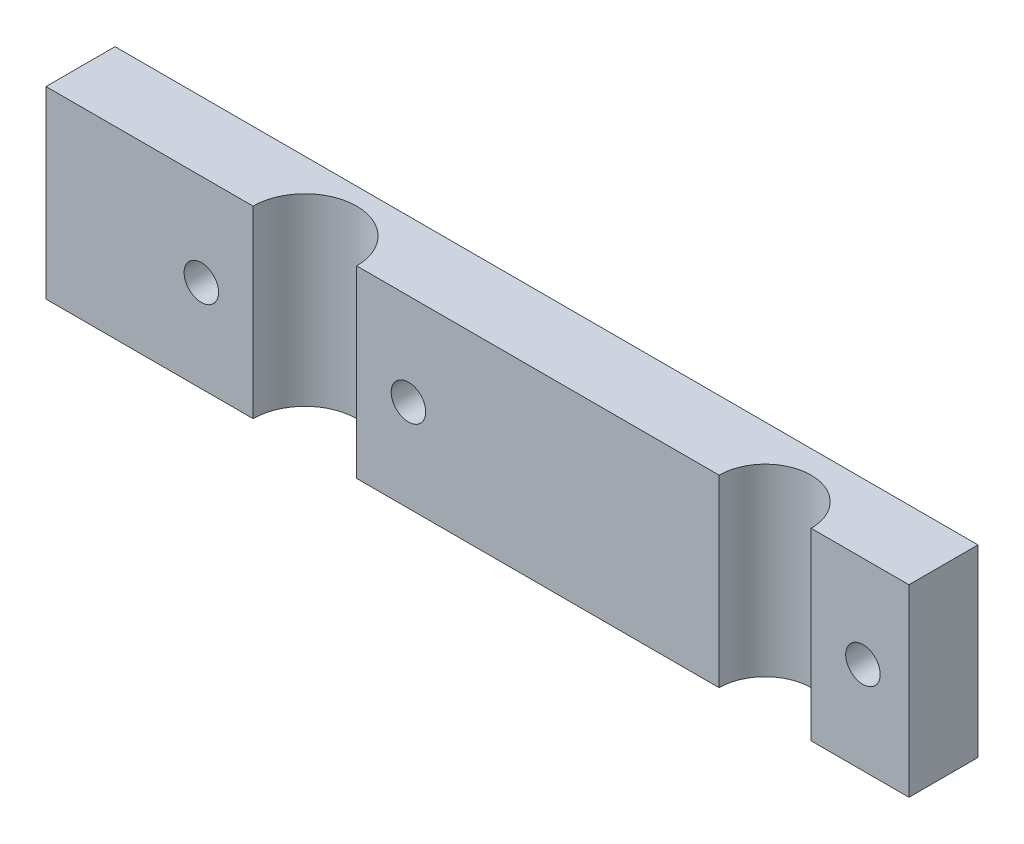
ISO-10303-21;
HEADER;
FILE_DESCRIPTION(('STEP AP214'),'2;1');
FILE_NAME('part.step','',(''),(''),'','','');
FILE_SCHEMA(('AUTOMOTIVE_DESIGN { 1 0 10303 214 1 1 1 1 }'));
ENDSEC;
DATA;
#1=APPLICATION_CONTEXT('core data for automotive mechanical design processes');
#2=APPLICATION_PROTOCOL_DEFINITION('international standard','automotive_design',2000,#1);
#3=PRODUCT_CONTEXT('',#1,'mechanical');
#4=PRODUCT('Part','Part','',(#3));
#5=PRODUCT_RELATED_PRODUCT_CATEGORY('part','',(#4));
#6=PRODUCT_DEFINITION_FORMATION('','',#4);
#7=PRODUCT_DEFINITION_CONTEXT('part definition',#1,'design');
#8=PRODUCT_DEFINITION('design','',#6,#7);
#9=PRODUCT_DEFINITION_SHAPE('','',#8);
#10=(LENGTH_UNIT() NAMED_UNIT(*) SI_UNIT(.MILLI.,.METRE.));
#11=(NAMED_UNIT(*) PLANE_ANGLE_UNIT() SI_UNIT($,.RADIAN.));
#12=(NAMED_UNIT(*) SI_UNIT($,.STERADIAN.) SOLID_ANGLE_UNIT());
#13=UNCERTAINTY_MEASURE_WITH_UNIT(LENGTH_MEASURE(1.E-05),#10,'distance_accuracy_value','');
#14=(GEOMETRIC_REPRESENTATION_CONTEXT(3) GLOBAL_UNCERTAINTY_ASSIGNED_CONTEXT((#13)) GLOBAL_UNIT_ASSIGNED_CONTEXT((#10,
#11,#12)) REPRESENTATION_CONTEXT('',''));
#15=CARTESIAN_POINT('',(0.,0.,0.));
#16=DIRECTION('',(0.,0.,1.));
#17=DIRECTION('',(1.,0.,0.));
#18=AXIS2_PLACEMENT_3D('',#15,#16,#17);
#19=CARTESIAN_POINT('',(0.,0.,12.));
#20=DIRECTION('',(0.,0.,1.));
#21=DIRECTION('',(1.,0.,0.));
#22=AXIS2_PLACEMENT_3D('',#19,#20,#21);
#23=PLANE('',#22);
#24=CARTESIAN_POINT('',(-12.,0.,12.));
#25=DIRECTION('',(0.,0.,1.));
#26=DIRECTION('',(1.,0.,0.));
#27=AXIS2_PLACEMENT_3D('',#24,#25,#26);
#28=CIRCLE('',#27,3.);
#29=CARTESIAN_POINT('',(-8.99999999999997,0.,12.));
#30=VERTEX_POINT('',#29);
#31=EDGE_CURVE('E164',#30,#30,#28,.T.);
#32=ORIENTED_EDGE('',*,*,#31,.F.);
#33=EDGE_LOOP('',(#32));
#34=FACE_BOUND('',#33,.T.);
#35=DIRECTION('',(0.,1.,0.));
#36=VECTOR('',#35,1.);
#37=CARTESIAN_POINT('',(-21.,-44.,12.));
#38=LINE('',#37,#36);
#39=CARTESIAN_POINT('',(-21.,-16.,12.));
#40=VERTEX_POINT('',#39);
#41=CARTESIAN_POINT('',(-21.,16.,12.));
#42=VERTEX_POINT('',#41);
#43=EDGE_CURVE('E11',#40,#42,#38,.T.);
#44=ORIENTED_EDGE('',*,*,#43,.F.);
#45=DIRECTION('',(1.,0.,0.));
#46=VECTOR('',#45,1.);
#47=CARTESIAN_POINT('',(-75.,-16.,12.));
#48=LINE('',#47,#46);
#49=CARTESIAN_POINT('',(42.,-16.,12.));
#50=VERTEX_POINT('',#49);
#51=EDGE_CURVE('E175',#40,#50,#48,.T.);
#52=ORIENTED_EDGE('',*,*,#51,.T.);
#53=DIRECTION('',(0.,1.,0.));
#54=VECTOR('',#53,1.);
#55=CARTESIAN_POINT('',(42.,-44.,12.));
#56=LINE('',#55,#54);
#57=CARTESIAN_POINT('',(42.,16.,12.));
#58=VERTEX_POINT('',#57);
#59=EDGE_CURVE('E115',#58,#50,#56,.F.);
#60=ORIENTED_EDGE('',*,*,#59,.F.);
#61=DIRECTION('',(-1.,0.,0.));
#62=VECTOR('',#61,1.);
#63=CARTESIAN_POINT('',(-75.,16.,12.));
#64=LINE('',#63,#62);
#65=EDGE_CURVE('E110',#58,#42,#64,.T.);
#66=ORIENTED_EDGE('',*,*,#65,.T.);
#67=EDGE_LOOP('',(#44,#52,#60,#66));
#68=FACE_BOUND('',#67,.T.);
#69=ADVANCED_FACE('F35',(#34,#68),#23,.T.);
#70=CARTESIAN_POINT('',(67.,0.,12.));
#71=DIRECTION('',(0.,0.,1.));
#72=DIRECTION('',(1.,0.,0.));
#73=AXIS2_PLACEMENT_3D('',#70,#71,#72);
#74=CIRCLE('',#73,3.00000000000001);
#75=CARTESIAN_POINT('',(70.,0.,12.));
#76=VERTEX_POINT('',#75);
#77=EDGE_CURVE('E151',#76,#76,#74,.T.);
#78=ORIENTED_EDGE('',*,*,#77,.F.);
#79=EDGE_LOOP('',(#78));
#80=FACE_BOUND('',#79,.T.);
#81=DIRECTION('',(0.,1.,0.));
#82=VECTOR('',#81,1.);
#83=CARTESIAN_POINT('',(58.,-44.,12.));
#84=LINE('',#83,#82);
#85=CARTESIAN_POINT('',(58.,-16.,12.));
#86=VERTEX_POINT('',#85);
#87=CARTESIAN_POINT('',(58.,16.,12.));
#88=VERTEX_POINT('',#87);
#89=EDGE_CURVE('E147',#86,#88,#84,.T.);
#90=ORIENTED_EDGE('',*,*,#89,.F.);
#91=CARTESIAN_POINT('',(75.,-16.,12.));
#92=VERTEX_POINT('',#91);
#93=EDGE_CURVE('E172',#86,#92,#48,.T.);
#94=ORIENTED_EDGE('',*,*,#93,.T.);
#95=DIRECTION('',(0.,1.,0.));
#96=VECTOR('',#95,1.);
#97=CARTESIAN_POINT('',(75.,16.,12.));
#98=LINE('',#97,#96);
#99=CARTESIAN_POINT('',(75.,16.,12.));
#100=VERTEX_POINT('',#99);
#101=EDGE_CURVE('E120',#92,#100,#98,.T.);
#102=ORIENTED_EDGE('',*,*,#101,.T.);
#103=EDGE_CURVE('E116',#100,#88,#64,.T.);
#104=ORIENTED_EDGE('',*,*,#103,.T.);
#105=EDGE_LOOP('',(#90,#94,#102,#104));
#106=FACE_BOUND('',#105,.T.);
#107=ADVANCED_FACE('F181',(#80,#106),#23,.T.);
#108=CARTESIAN_POINT('',(-75.,16.,12.));
#109=DIRECTION('',(1.,0.,0.));
#110=DIRECTION('',(0.,0.,-1.));
#111=AXIS2_PLACEMENT_3D('',#108,#109,#110);
#112=PLANE('',#111);
#113=DIRECTION('',(0.,-1.,0.));
#114=VECTOR('',#113,1.);
#115=CARTESIAN_POINT('',(-75.,16.,0.));
#116=LINE('',#115,#114);
#117=CARTESIAN_POINT('',(-75.,16.,0.));
#118=VERTEX_POINT('',#117);
#119=CARTESIAN_POINT('',(-75.,-16.,0.));
#120=VERTEX_POINT('',#119);
#121=EDGE_CURVE('E124',#118,#120,#116,.T.);
#122=ORIENTED_EDGE('',*,*,#121,.T.);
#123=DIRECTION('',(0.,0.,-1.));
#124=VECTOR('',#123,1.);
#125=CARTESIAN_POINT('',(-75.,-16.,12.));
#126=LINE('',#125,#124);
#127=CARTESIAN_POINT('',(-75.,-16.,12.));
#128=VERTEX_POINT('',#127);
#129=EDGE_CURVE('E143',#128,#120,#126,.T.);
#130=ORIENTED_EDGE('',*,*,#129,.F.);
#131=DIRECTION('',(0.,-1.,0.));
#132=VECTOR('',#131,1.);
#133=CARTESIAN_POINT('',(-75.,16.,12.));
#134=LINE('',#133,#132);
#135=CARTESIAN_POINT('',(-75.,16.,12.));
#136=VERTEX_POINT('',#135);
#137=EDGE_CURVE('E134',#136,#128,#134,.T.);
#138=ORIENTED_EDGE('',*,*,#137,.F.);
#139=DIRECTION('',(0.,0.,-1.));
#140=VECTOR('',#139,1.);
#141=CARTESIAN_POINT('',(-75.,16.,12.));
#142=LINE('',#141,#140);
#143=EDGE_CURVE('E119',#136,#118,#142,.T.);
#144=ORIENTED_EDGE('',*,*,#143,.T.);
#145=EDGE_LOOP('',(#122,#130,#138,#144));
#146=FACE_BOUND('',#145,.T.);
#147=ADVANCED_FACE('F37',(#146),#112,.F.);
#148=CARTESIAN_POINT('',(-75.,-16.,12.));
#149=DIRECTION('',(0.,1.,0.));
#150=DIRECTION('',(0.,0.,1.));
#151=AXIS2_PLACEMENT_3D('',#148,#149,#150);
#152=PLANE('',#151);
#153=ORIENTED_EDGE('',*,*,#51,.F.);
#154=CARTESIAN_POINT('',(-30.,-16.,12.));
#155=DIRECTION('',(0.,1.,0.));
#156=DIRECTION('',(0.,0.,1.));
#157=AXIS2_PLACEMENT_3D('',#154,#155,#156);
#158=CIRCLE('',#157,9.);
#159=CARTESIAN_POINT('',(-39.,-16.,12.));
#160=VERTEX_POINT('',#159);
#161=EDGE_CURVE('E102',#40,#160,#158,.T.);
#162=ORIENTED_EDGE('',*,*,#161,.T.);
#163=EDGE_CURVE('E173',#128,#160,#48,.T.);
#164=ORIENTED_EDGE('',*,*,#163,.F.);
#165=ORIENTED_EDGE('',*,*,#129,.T.);
#166=DIRECTION('',(1.,0.,0.));
#167=VECTOR('',#166,1.);
#168=CARTESIAN_POINT('',(-75.,-16.,0.));
#169=LINE('',#168,#167);
#170=CARTESIAN_POINT('',(75.,-16.,0.));
#171=VERTEX_POINT('',#170);
#172=EDGE_CURVE('E127',#120,#171,#169,.T.);
#173=ORIENTED_EDGE('',*,*,#172,.T.);
#174=DIRECTION('',(0.,0.,-1.));
#175=VECTOR('',#174,1.);
#176=CARTESIAN_POINT('',(75.,-16.,12.));
#177=LINE('',#176,#175);
#178=EDGE_CURVE('E140',#92,#171,#177,.T.);
#179=ORIENTED_EDGE('',*,*,#178,.F.);
#180=ORIENTED_EDGE('',*,*,#93,.F.);
#181=CARTESIAN_POINT('',(50.,-16.,12.));
#182=DIRECTION('',(0.,1.,0.));
#183=DIRECTION('',(0.,0.,1.));
#184=AXIS2_PLACEMENT_3D('',#181,#182,#183);
#185=CIRCLE('',#184,8.00000000000001);
#186=EDGE_CURVE('E128',#86,#50,#185,.T.);
#187=ORIENTED_EDGE('',*,*,#186,.T.);
#188=EDGE_LOOP('',(#153,#162,#164,#165,#173,#179,#180,#187));
#189=FACE_BOUND('',#188,.T.);
#190=ADVANCED_FACE('F185',(#189),#152,.F.);
#191=CARTESIAN_POINT('',(75.,16.,12.));
#192=DIRECTION('',(-1.,0.,0.));
#193=DIRECTION('',(0.,0.,1.));
#194=AXIS2_PLACEMENT_3D('',#191,#192,#193);
#195=PLANE('',#194);
#196=DIRECTION('',(0.,1.,0.));
#197=VECTOR('',#196,1.);
#198=CARTESIAN_POINT('',(75.,16.,0.));
#199=LINE('',#198,#197);
#200=CARTESIAN_POINT('',(75.,16.,0.));
#201=VERTEX_POINT('',#200);
#202=EDGE_CURVE('E130',#171,#201,#199,.T.);
#203=ORIENTED_EDGE('',*,*,#202,.T.);
#204=DIRECTION('',(0.,0.,-1.));
#205=VECTOR('',#204,1.);
#206=CARTESIAN_POINT('',(75.,16.,12.));
#207=LINE('',#206,#205);
#208=EDGE_CURVE('E137',#100,#201,#207,.T.);
#209=ORIENTED_EDGE('',*,*,#208,.F.);
#210=ORIENTED_EDGE('',*,*,#101,.F.);
#211=ORIENTED_EDGE('',*,*,#178,.T.);
#212=EDGE_LOOP('',(#203,#209,#210,#211));
#213=FACE_BOUND('',#212,.T.);
#214=ADVANCED_FACE('F188',(#213),#195,.F.);
#215=CARTESIAN_POINT('',(-75.,16.,12.));
#216=DIRECTION('',(0.,-1.,0.));
#217=DIRECTION('',(0.,0.,-1.));
#218=AXIS2_PLACEMENT_3D('',#215,#216,#217);
#219=PLANE('',#218);
#220=CARTESIAN_POINT('',(-39.,16.,12.));
#221=VERTEX_POINT('',#220);
#222=EDGE_CURVE('E112',#221,#136,#64,.T.);
#223=ORIENTED_EDGE('',*,*,#222,.F.);
#224=CARTESIAN_POINT('',(-30.,16.,12.));
#225=DIRECTION('',(0.,1.,0.));
#226=DIRECTION('',(0.,0.,1.));
#227=AXIS2_PLACEMENT_3D('',#224,#225,#226);
#228=CIRCLE('',#227,9.);
#229=EDGE_CURVE('E51',#42,#221,#228,.T.);
#230=ORIENTED_EDGE('',*,*,#229,.F.);
#231=ORIENTED_EDGE('',*,*,#65,.F.);
#232=CARTESIAN_POINT('',(50.,16.,12.));
#233=DIRECTION('',(0.,1.,0.));
#234=DIRECTION('',(0.,0.,1.));
#235=AXIS2_PLACEMENT_3D('',#232,#233,#234);
#236=CIRCLE('',#235,8.00000000000001);
#237=EDGE_CURVE('E59',#88,#58,#236,.T.);
#238=ORIENTED_EDGE('',*,*,#237,.F.);
#239=ORIENTED_EDGE('',*,*,#103,.F.);
#240=ORIENTED_EDGE('',*,*,#208,.T.);
#241=DIRECTION('',(-1.,0.,0.));
#242=VECTOR('',#241,1.);
#243=CARTESIAN_POINT('',(-75.,16.,0.));
#244=LINE('',#243,#242);
#245=EDGE_CURVE('E132',#201,#118,#244,.T.);
#246=ORIENTED_EDGE('',*,*,#245,.T.);
#247=ORIENTED_EDGE('',*,*,#143,.F.);
#248=EDGE_LOOP('',(#223,#230,#231,#238,#239,#240,#246,#247));
#249=FACE_BOUND('',#248,.T.);
#250=ADVANCED_FACE('F109',(#249),#219,.F.);
#251=CARTESIAN_POINT('',(-48.,0.,12.));
#252=DIRECTION('',(0.,0.,1.));
#253=DIRECTION('',(1.,0.,0.));
#254=AXIS2_PLACEMENT_3D('',#251,#252,#253);
#255=CIRCLE('',#254,3.);
#256=CARTESIAN_POINT('',(-45.,0.,12.));
#257=VERTEX_POINT('',#256);
#258=EDGE_CURVE('E154',#257,#257,#255,.T.);
#259=ORIENTED_EDGE('',*,*,#258,.F.);
#260=EDGE_LOOP('',(#259));
#261=FACE_BOUND('',#260,.T.);
#262=DIRECTION('',(0.,1.,0.));
#263=VECTOR('',#262,1.);
#264=CARTESIAN_POINT('',(-39.,-44.,12.));
#265=LINE('',#264,#263);
#266=EDGE_CURVE('E44',#221,#160,#265,.F.);
#267=ORIENTED_EDGE('',*,*,#266,.F.);
#268=ORIENTED_EDGE('',*,*,#222,.T.);
#269=ORIENTED_EDGE('',*,*,#137,.T.);
#270=ORIENTED_EDGE('',*,*,#163,.T.);
#271=EDGE_LOOP('',(#267,#268,#269,#270));
#272=FACE_BOUND('',#271,.T.);
#273=ADVANCED_FACE('F197',(#261,#272),#23,.T.);
#274=CARTESIAN_POINT('',(0.,0.,0.));
#275=DIRECTION('',(0.,0.,1.));
#276=DIRECTION('',(1.,0.,0.));
#277=AXIS2_PLACEMENT_3D('',#274,#275,#276);
#278=PLANE('',#277);
#279=CARTESIAN_POINT('',(-12.,0.,0.));
#280=DIRECTION('',(0.,0.,1.));
#281=DIRECTION('',(1.,0.,0.));
#282=AXIS2_PLACEMENT_3D('',#279,#280,#281);
#283=CIRCLE('',#282,3.);
#284=CARTESIAN_POINT('',(-8.99999999999997,0.,0.));
#285=VERTEX_POINT('',#284);
#286=EDGE_CURVE('E39',#285,#285,#283,.T.);
#287=ORIENTED_EDGE('',*,*,#286,.T.);
#288=EDGE_LOOP('',(#287));
#289=FACE_BOUND('',#288,.T.);
#290=CARTESIAN_POINT('',(-48.,0.,0.));
#291=DIRECTION('',(0.,0.,1.));
#292=DIRECTION('',(1.,0.,0.));
#293=AXIS2_PLACEMENT_3D('',#290,#291,#292);
#294=CIRCLE('',#293,3.);
#295=CARTESIAN_POINT('',(-45.,0.,0.));
#296=VERTEX_POINT('',#295);
#297=EDGE_CURVE('E152',#296,#296,#294,.T.);
#298=ORIENTED_EDGE('',*,*,#297,.T.);
#299=EDGE_LOOP('',(#298));
#300=FACE_BOUND('',#299,.T.);
#301=CARTESIAN_POINT('',(67.,0.,0.));
#302=DIRECTION('',(0.,0.,1.));
#303=DIRECTION('',(1.,0.,0.));
#304=AXIS2_PLACEMENT_3D('',#301,#302,#303);
#305=CIRCLE('',#304,3.00000000000001);
#306=CARTESIAN_POINT('',(70.,0.,0.));
#307=VERTEX_POINT('',#306);
#308=EDGE_CURVE('E113',#307,#307,#305,.T.);
#309=ORIENTED_EDGE('',*,*,#308,.T.);
#310=EDGE_LOOP('',(#309));
#311=FACE_BOUND('',#310,.T.);
#312=ORIENTED_EDGE('',*,*,#121,.F.);
#313=ORIENTED_EDGE('',*,*,#245,.F.);
#314=ORIENTED_EDGE('',*,*,#202,.F.);
#315=ORIENTED_EDGE('',*,*,#172,.F.);
#316=EDGE_LOOP('',(#312,#313,#314,#315));
#317=FACE_BOUND('',#316,.T.);
#318=ADVANCED_FACE('F193',(#289,#300,#311,#317),#278,.F.);
#319=CARTESIAN_POINT('',(50.,-44.,12.));
#320=DIRECTION('',(0.,1.,0.));
#321=DIRECTION('',(0.,0.,1.));
#322=AXIS2_PLACEMENT_3D('',#319,#320,#321);
#323=CYLINDRICAL_SURFACE('',#322,8.00000000000001);
#324=ORIENTED_EDGE('',*,*,#89,.T.);
#325=ORIENTED_EDGE('',*,*,#237,.T.);
#326=ORIENTED_EDGE('',*,*,#59,.T.);
#327=ORIENTED_EDGE('',*,*,#186,.F.);
#328=EDGE_LOOP('',(#324,#325,#326,#327));
#329=FACE_BOUND('',#328,.T.);
#330=ADVANCED_FACE('F198',(#329),#323,.F.);
#331=CARTESIAN_POINT('',(-30.,-44.,12.));
#332=DIRECTION('',(0.,1.,0.));
#333=DIRECTION('',(0.,0.,1.));
#334=AXIS2_PLACEMENT_3D('',#331,#332,#333);
#335=CYLINDRICAL_SURFACE('',#334,9.);
#336=ORIENTED_EDGE('',*,*,#43,.T.);
#337=ORIENTED_EDGE('',*,*,#229,.T.);
#338=ORIENTED_EDGE('',*,*,#266,.T.);
#339=ORIENTED_EDGE('',*,*,#161,.F.);
#340=EDGE_LOOP('',(#336,#337,#338,#339));
#341=FACE_BOUND('',#340,.T.);
#342=ADVANCED_FACE('F100',(#341),#335,.F.);
#343=CARTESIAN_POINT('',(67.,0.,-18.));
#344=DIRECTION('',(0.,0.,1.));
#345=DIRECTION('',(1.,0.,0.));
#346=AXIS2_PLACEMENT_3D('',#343,#344,#345);
#347=CYLINDRICAL_SURFACE('',#346,3.00000000000001);
#348=ORIENTED_EDGE('',*,*,#77,.T.);
#349=EDGE_LOOP('',(#348));
#350=FACE_BOUND('',#349,.T.);
#351=ORIENTED_EDGE('',*,*,#308,.F.);
#352=EDGE_LOOP('',(#351));
#353=FACE_BOUND('',#352,.T.);
#354=ADVANCED_FACE('F205',(#350,#353),#347,.F.);
#355=CARTESIAN_POINT('',(-48.,0.,-18.));
#356=DIRECTION('',(0.,0.,1.));
#357=DIRECTION('',(1.,0.,0.));
#358=AXIS2_PLACEMENT_3D('',#355,#356,#357);
#359=CYLINDRICAL_SURFACE('',#358,3.);
#360=ORIENTED_EDGE('',*,*,#258,.T.);
#361=EDGE_LOOP('',(#360));
#362=FACE_BOUND('',#361,.T.);
#363=ORIENTED_EDGE('',*,*,#297,.F.);
#364=EDGE_LOOP('',(#363));
#365=FACE_BOUND('',#364,.T.);
#366=ADVANCED_FACE('F261',(#362,#365),#359,.F.);
#367=CARTESIAN_POINT('',(-12.,0.,-18.));
#368=DIRECTION('',(0.,0.,1.));
#369=DIRECTION('',(1.,0.,0.));
#370=AXIS2_PLACEMENT_3D('',#367,#368,#369);
#371=CYLINDRICAL_SURFACE('',#370,3.);
#372=ORIENTED_EDGE('',*,*,#31,.T.);
#373=EDGE_LOOP('',(#372));
#374=FACE_BOUND('',#373,.T.);
#375=ORIENTED_EDGE('',*,*,#286,.F.);
#376=EDGE_LOOP('',(#375));
#377=FACE_BOUND('',#376,.T.);
#378=ADVANCED_FACE('F272',(#374,#377),#371,.F.);
#379=CLOSED_SHELL('',(#69,#107,#147,#190,#214,#250,#273,#318,#330,#342,#354,#366,#378));
#380=MANIFOLD_SOLID_BREP('B2',#379);
#381=ADVANCED_BREP_SHAPE_REPRESENTATION('',(#18,#380),#14);
#382=SHAPE_DEFINITION_REPRESENTATION(#9,#381);
ENDSEC;
END-ISO-10303-21;
